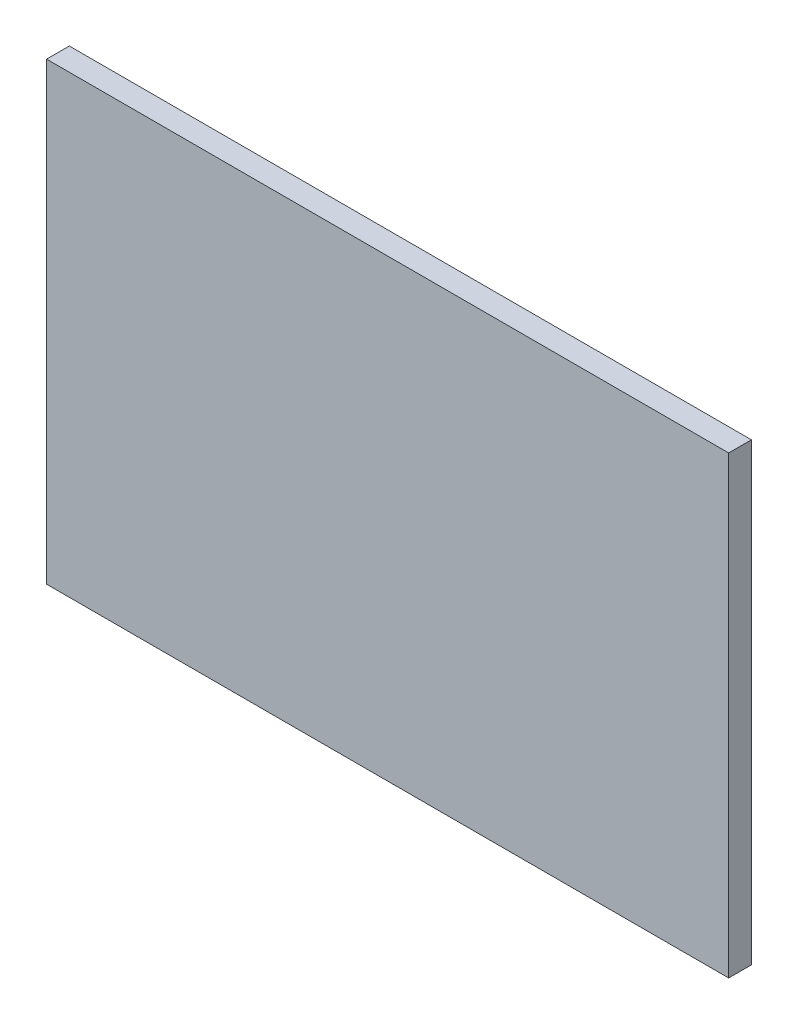
ISO-10303-21;
HEADER;
FILE_DESCRIPTION(('STEP AP214'),'2;1');
FILE_NAME('part.step','',(''),(''),'','','');
FILE_SCHEMA(('AUTOMOTIVE_DESIGN { 1 0 10303 214 1 1 1 1 }'));
ENDSEC;
DATA;
#1=APPLICATION_CONTEXT('core data for automotive mechanical design processes');
#2=APPLICATION_PROTOCOL_DEFINITION('international standard','automotive_design',2000,#1);
#3=PRODUCT_CONTEXT('',#1,'mechanical');
#4=PRODUCT('Part','Part','',(#3));
#5=PRODUCT_RELATED_PRODUCT_CATEGORY('part','',(#4));
#6=PRODUCT_DEFINITION_FORMATION('','',#4);
#7=PRODUCT_DEFINITION_CONTEXT('part definition',#1,'design');
#8=PRODUCT_DEFINITION('design','',#6,#7);
#9=PRODUCT_DEFINITION_SHAPE('','',#8);
#10=(LENGTH_UNIT() NAMED_UNIT(*) SI_UNIT(.MILLI.,.METRE.));
#11=(NAMED_UNIT(*) PLANE_ANGLE_UNIT() SI_UNIT($,.RADIAN.));
#12=(NAMED_UNIT(*) SI_UNIT($,.STERADIAN.) SOLID_ANGLE_UNIT());
#13=UNCERTAINTY_MEASURE_WITH_UNIT(LENGTH_MEASURE(1.E-05),#10,'distance_accuracy_value','');
#14=(GEOMETRIC_REPRESENTATION_CONTEXT(3) GLOBAL_UNCERTAINTY_ASSIGNED_CONTEXT((#13)) GLOBAL_UNIT_ASSIGNED_CONTEXT((#10,
#11,#12)) REPRESENTATION_CONTEXT('',''));
#15=CARTESIAN_POINT('',(0.,0.,0.));
#16=DIRECTION('',(0.,0.,1.));
#17=DIRECTION('',(1.,0.,0.));
#18=AXIS2_PLACEMENT_3D('',#15,#16,#17);
#19=CARTESIAN_POINT('',(0.,0.,5.));
#20=DIRECTION('',(1.,0.,0.));
#21=DIRECTION('',(0.,0.,-1.));
#22=AXIS2_PLACEMENT_3D('',#19,#20,#21);
#23=PLANE('',#22);
#24=DIRECTION('',(0.,-1.,0.));
#25=VECTOR('',#24,1.);
#26=CARTESIAN_POINT('',(0.,0.,0.));
#27=LINE('',#26,#25);
#28=CARTESIAN_POINT('',(0.,100.,0.));
#29=VERTEX_POINT('',#28);
#30=CARTESIAN_POINT('',(0.,0.,0.));
#31=VERTEX_POINT('',#30);
#32=EDGE_CURVE('E96',#29,#31,#27,.T.);
#33=ORIENTED_EDGE('',*,*,#32,.T.);
#34=DIRECTION('',(0.,0.,-1.));
#35=VECTOR('',#34,1.);
#36=CARTESIAN_POINT('',(0.,0.,5.));
#37=LINE('',#36,#35);
#38=CARTESIAN_POINT('',(0.,0.,5.));
#39=VERTEX_POINT('',#38);
#40=EDGE_CURVE('E11',#39,#31,#37,.T.);
#41=ORIENTED_EDGE('',*,*,#40,.F.);
#42=DIRECTION('',(0.,-1.,0.));
#43=VECTOR('',#42,1.);
#44=CARTESIAN_POINT('',(0.,0.,5.));
#45=LINE('',#44,#43);
#46=CARTESIAN_POINT('',(0.,100.,5.));
#47=VERTEX_POINT('',#46);
#48=EDGE_CURVE('E84',#47,#39,#45,.T.);
#49=ORIENTED_EDGE('',*,*,#48,.F.);
#50=DIRECTION('',(0.,0.,-1.));
#51=VECTOR('',#50,1.);
#52=CARTESIAN_POINT('',(0.,100.,5.));
#53=LINE('',#52,#51);
#54=EDGE_CURVE('E92',#47,#29,#53,.T.);
#55=ORIENTED_EDGE('',*,*,#54,.T.);
#56=EDGE_LOOP('',(#33,#41,#49,#55));
#57=FACE_BOUND('',#56,.T.);
#58=ADVANCED_FACE('F33',(#57),#23,.F.);
#59=CARTESIAN_POINT('',(0.,0.,5.));
#60=DIRECTION('',(0.,1.,0.));
#61=DIRECTION('',(0.,0.,1.));
#62=AXIS2_PLACEMENT_3D('',#59,#60,#61);
#63=PLANE('',#62);
#64=DIRECTION('',(1.,0.,0.));
#65=VECTOR('',#64,1.);
#66=CARTESIAN_POINT('',(0.,0.,0.));
#67=LINE('',#66,#65);
#68=CARTESIAN_POINT('',(150.,0.,0.));
#69=VERTEX_POINT('',#68);
#70=EDGE_CURVE('E88',#31,#69,#67,.T.);
#71=ORIENTED_EDGE('',*,*,#70,.T.);
#72=DIRECTION('',(0.,0.,-1.));
#73=VECTOR('',#72,1.);
#74=CARTESIAN_POINT('',(150.,0.,5.));
#75=LINE('',#74,#73);
#76=CARTESIAN_POINT('',(150.,0.,5.));
#77=VERTEX_POINT('',#76);
#78=EDGE_CURVE('E41',#77,#69,#75,.T.);
#79=ORIENTED_EDGE('',*,*,#78,.F.);
#80=DIRECTION('',(1.,0.,0.));
#81=VECTOR('',#80,1.);
#82=CARTESIAN_POINT('',(0.,0.,5.));
#83=LINE('',#82,#81);
#84=EDGE_CURVE('E79',#39,#77,#83,.T.);
#85=ORIENTED_EDGE('',*,*,#84,.F.);
#86=ORIENTED_EDGE('',*,*,#40,.T.);
#87=EDGE_LOOP('',(#71,#79,#85,#86));
#88=FACE_BOUND('',#87,.T.);
#89=ADVANCED_FACE('F87',(#88),#63,.F.);
#90=CARTESIAN_POINT('',(150.,0.,5.));
#91=DIRECTION('',(-1.,0.,0.));
#92=DIRECTION('',(0.,0.,1.));
#93=AXIS2_PLACEMENT_3D('',#90,#91,#92);
#94=PLANE('',#93);
#95=DIRECTION('',(0.,1.,0.));
#96=VECTOR('',#95,1.);
#97=CARTESIAN_POINT('',(150.,0.,0.));
#98=LINE('',#97,#96);
#99=CARTESIAN_POINT('',(150.,100.,0.));
#100=VERTEX_POINT('',#99);
#101=EDGE_CURVE('E66',#69,#100,#98,.T.);
#102=ORIENTED_EDGE('',*,*,#101,.T.);
#103=DIRECTION('',(0.,0.,-1.));
#104=VECTOR('',#103,1.);
#105=CARTESIAN_POINT('',(150.,100.,5.));
#106=LINE('',#105,#104);
#107=CARTESIAN_POINT('',(150.,100.,5.));
#108=VERTEX_POINT('',#107);
#109=EDGE_CURVE('E89',#108,#100,#106,.T.);
#110=ORIENTED_EDGE('',*,*,#109,.F.);
#111=DIRECTION('',(0.,1.,0.));
#112=VECTOR('',#111,1.);
#113=CARTESIAN_POINT('',(150.,0.,5.));
#114=LINE('',#113,#112);
#115=EDGE_CURVE('E82',#77,#108,#114,.T.);
#116=ORIENTED_EDGE('',*,*,#115,.F.);
#117=ORIENTED_EDGE('',*,*,#78,.T.);
#118=EDGE_LOOP('',(#102,#110,#116,#117));
#119=FACE_BOUND('',#118,.T.);
#120=ADVANCED_FACE('F90',(#119),#94,.F.);
#121=CARTESIAN_POINT('',(0.,100.,5.));
#122=DIRECTION('',(0.,-1.,0.));
#123=DIRECTION('',(0.,0.,-1.));
#124=AXIS2_PLACEMENT_3D('',#121,#122,#123);
#125=PLANE('',#124);
#126=DIRECTION('',(-1.,0.,0.));
#127=VECTOR('',#126,1.);
#128=CARTESIAN_POINT('',(0.,100.,0.));
#129=LINE('',#128,#127);
#130=EDGE_CURVE('E72',#100,#29,#129,.T.);
#131=ORIENTED_EDGE('',*,*,#130,.T.);
#132=ORIENTED_EDGE('',*,*,#54,.F.);
#133=DIRECTION('',(-1.,0.,0.));
#134=VECTOR('',#133,1.);
#135=CARTESIAN_POINT('',(0.,100.,5.));
#136=LINE('',#135,#134);
#137=EDGE_CURVE('E49',#108,#47,#136,.T.);
#138=ORIENTED_EDGE('',*,*,#137,.F.);
#139=ORIENTED_EDGE('',*,*,#109,.T.);
#140=EDGE_LOOP('',(#131,#132,#138,#139));
#141=FACE_BOUND('',#140,.T.);
#142=ADVANCED_FACE('F103',(#141),#125,.F.);
#143=CARTESIAN_POINT('',(0.,0.,5.));
#144=DIRECTION('',(0.,0.,-1.));
#145=DIRECTION('',(-1.,0.,0.));
#146=AXIS2_PLACEMENT_3D('',#143,#144,#145);
#147=PLANE('',#146);
#148=ORIENTED_EDGE('',*,*,#48,.T.);
#149=ORIENTED_EDGE('',*,*,#84,.T.);
#150=ORIENTED_EDGE('',*,*,#115,.T.);
#151=ORIENTED_EDGE('',*,*,#137,.T.);
#152=EDGE_LOOP('',(#148,#149,#150,#151));
#153=FACE_BOUND('',#152,.T.);
#154=ADVANCED_FACE('F80',(#153),#147,.F.);
#155=CARTESIAN_POINT('',(0.,0.,0.));
#156=DIRECTION('',(0.,0.,-1.));
#157=DIRECTION('',(-1.,0.,0.));
#158=AXIS2_PLACEMENT_3D('',#155,#156,#157);
#159=PLANE('',#158);
#160=ORIENTED_EDGE('',*,*,#32,.F.);
#161=ORIENTED_EDGE('',*,*,#130,.F.);
#162=ORIENTED_EDGE('',*,*,#101,.F.);
#163=ORIENTED_EDGE('',*,*,#70,.F.);
#164=EDGE_LOOP('',(#160,#161,#162,#163));
#165=FACE_BOUND('',#164,.T.);
#166=ADVANCED_FACE('F106',(#165),#159,.T.);
#167=CLOSED_SHELL('',(#58,#89,#120,#142,#154,#166));
#168=MANIFOLD_SOLID_BREP('B2',#167);
#169=ADVANCED_BREP_SHAPE_REPRESENTATION('',(#18,#168),#14);
#170=SHAPE_DEFINITION_REPRESENTATION(#9,#169);
ENDSEC;
END-ISO-10303-21;
